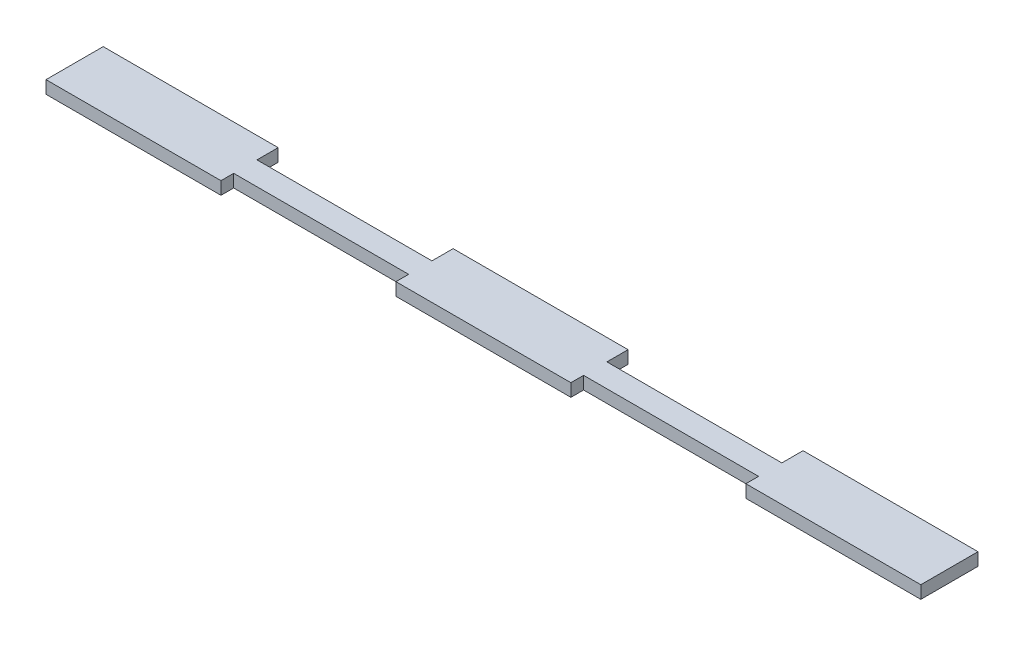
ISO-10303-21;
HEADER;
FILE_DESCRIPTION(('STEP AP214'),'2;1');
FILE_NAME('part.step','',(''),(''),'','','');
FILE_SCHEMA(('AUTOMOTIVE_DESIGN { 1 0 10303 214 1 1 1 1 }'));
ENDSEC;
DATA;
#1=APPLICATION_CONTEXT('core data for automotive mechanical design processes');
#2=APPLICATION_PROTOCOL_DEFINITION('international standard','automotive_design',2000,#1);
#3=PRODUCT_CONTEXT('',#1,'mechanical');
#4=PRODUCT('Part','Part','',(#3));
#5=PRODUCT_RELATED_PRODUCT_CATEGORY('part','',(#4));
#6=PRODUCT_DEFINITION_FORMATION('','',#4);
#7=PRODUCT_DEFINITION_CONTEXT('part definition',#1,'design');
#8=PRODUCT_DEFINITION('design','',#6,#7);
#9=PRODUCT_DEFINITION_SHAPE('','',#8);
#10=(LENGTH_UNIT() NAMED_UNIT(*) SI_UNIT(.MILLI.,.METRE.));
#11=(NAMED_UNIT(*) PLANE_ANGLE_UNIT() SI_UNIT($,.RADIAN.));
#12=(NAMED_UNIT(*) SI_UNIT($,.STERADIAN.) SOLID_ANGLE_UNIT());
#13=UNCERTAINTY_MEASURE_WITH_UNIT(LENGTH_MEASURE(1.E-05),#10,'distance_accuracy_value','');
#14=(GEOMETRIC_REPRESENTATION_CONTEXT(3) GLOBAL_UNCERTAINTY_ASSIGNED_CONTEXT((#13)) GLOBAL_UNIT_ASSIGNED_CONTEXT((#10,
#11,#12)) REPRESENTATION_CONTEXT('',''));
#15=CARTESIAN_POINT('',(0.,0.,0.));
#16=DIRECTION('',(0.,0.,1.));
#17=DIRECTION('',(1.,0.,0.));
#18=AXIS2_PLACEMENT_3D('',#15,#16,#17);
#19=CARTESIAN_POINT('',(61.9499999999999,3.,6.75));
#20=DIRECTION('',(0.,0.,-1.));
#21=DIRECTION('',(-1.,0.,0.));
#22=AXIS2_PLACEMENT_3D('',#19,#20,#21);
#23=PLANE('',#22);
#24=DIRECTION('',(1.,0.,0.));
#25=VECTOR('',#24,1.);
#26=CARTESIAN_POINT('',(61.9499999999999,0.,6.75));
#27=LINE('',#26,#25);
#28=CARTESIAN_POINT('',(61.9499999999999,0.,6.75));
#29=VERTEX_POINT('',#28);
#30=CARTESIAN_POINT('',(103.25,0.,6.75));
#31=VERTEX_POINT('',#30);
#32=EDGE_CURVE('E200',#29,#31,#27,.T.);
#33=ORIENTED_EDGE('',*,*,#32,.T.);
#34=DIRECTION('',(0.,-1.,0.));
#35=VECTOR('',#34,1.);
#36=CARTESIAN_POINT('',(103.25,3.,6.75));
#37=LINE('',#36,#35);
#38=CARTESIAN_POINT('',(103.25,3.,6.75));
#39=VERTEX_POINT('',#38);
#40=EDGE_CURVE('E11',#39,#31,#37,.T.);
#41=ORIENTED_EDGE('',*,*,#40,.F.);
#42=DIRECTION('',(1.,0.,0.));
#43=VECTOR('',#42,1.);
#44=CARTESIAN_POINT('',(61.9499999999999,3.,6.75));
#45=LINE('',#44,#43);
#46=CARTESIAN_POINT('',(61.9499999999999,3.,6.75));
#47=VERTEX_POINT('',#46);
#48=EDGE_CURVE('E238',#47,#39,#45,.T.);
#49=ORIENTED_EDGE('',*,*,#48,.F.);
#50=DIRECTION('',(0.,-1.,0.));
#51=VECTOR('',#50,1.);
#52=CARTESIAN_POINT('',(61.9499999999999,3.,6.75));
#53=LINE('',#52,#51);
#54=EDGE_CURVE('E196',#47,#29,#53,.T.);
#55=ORIENTED_EDGE('',*,*,#54,.T.);
#56=EDGE_LOOP('',(#33,#41,#49,#55));
#57=FACE_BOUND('',#56,.T.);
#58=ADVANCED_FACE('F32',(#57),#23,.F.);
#59=CARTESIAN_POINT('',(103.25,3.,-6.75));
#60=DIRECTION('',(-1.,0.,0.));
#61=DIRECTION('',(0.,0.,1.));
#62=AXIS2_PLACEMENT_3D('',#59,#60,#61);
#63=PLANE('',#62);
#64=DIRECTION('',(0.,0.,-1.));
#65=VECTOR('',#64,1.);
#66=CARTESIAN_POINT('',(103.25,0.,-6.75));
#67=LINE('',#66,#65);
#68=CARTESIAN_POINT('',(103.25,0.,-6.75));
#69=VERTEX_POINT('',#68);
#70=EDGE_CURVE('E203',#31,#69,#67,.T.);
#71=ORIENTED_EDGE('',*,*,#70,.T.);
#72=DIRECTION('',(0.,-1.,0.));
#73=VECTOR('',#72,1.);
#74=CARTESIAN_POINT('',(103.25,3.,-6.75));
#75=LINE('',#74,#73);
#76=CARTESIAN_POINT('',(103.25,3.,-6.75));
#77=VERTEX_POINT('',#76);
#78=EDGE_CURVE('E40',#77,#69,#75,.T.);
#79=ORIENTED_EDGE('',*,*,#78,.F.);
#80=DIRECTION('',(0.,0.,-1.));
#81=VECTOR('',#80,1.);
#82=CARTESIAN_POINT('',(103.25,3.,-6.75));
#83=LINE('',#82,#81);
#84=EDGE_CURVE('E127',#39,#77,#83,.T.);
#85=ORIENTED_EDGE('',*,*,#84,.F.);
#86=ORIENTED_EDGE('',*,*,#40,.T.);
#87=EDGE_LOOP('',(#71,#79,#85,#86));
#88=FACE_BOUND('',#87,.T.);
#89=ADVANCED_FACE('F356',(#88),#63,.F.);
#90=CARTESIAN_POINT('',(61.9499999999999,3.,-6.75));
#91=DIRECTION('',(0.,0.,1.));
#92=DIRECTION('',(1.,0.,0.));
#93=AXIS2_PLACEMENT_3D('',#90,#91,#92);
#94=PLANE('',#93);
#95=DIRECTION('',(-1.,0.,0.));
#96=VECTOR('',#95,1.);
#97=CARTESIAN_POINT('',(61.9499999999999,0.,-6.75));
#98=LINE('',#97,#96);
#99=CARTESIAN_POINT('',(61.9499999999999,0.,-6.75));
#100=VERTEX_POINT('',#99);
#101=EDGE_CURVE('E205',#69,#100,#98,.T.);
#102=ORIENTED_EDGE('',*,*,#101,.T.);
#103=DIRECTION('',(0.,-1.,0.));
#104=VECTOR('',#103,1.);
#105=CARTESIAN_POINT('',(61.9499999999999,3.,-6.75));
#106=LINE('',#105,#104);
#107=CARTESIAN_POINT('',(61.9499999999999,3.,-6.75));
#108=VERTEX_POINT('',#107);
#109=EDGE_CURVE('E281',#108,#100,#106,.T.);
#110=ORIENTED_EDGE('',*,*,#109,.F.);
#111=DIRECTION('',(-1.,0.,0.));
#112=VECTOR('',#111,1.);
#113=CARTESIAN_POINT('',(61.9499999999999,3.,-6.75));
#114=LINE('',#113,#112);
#115=EDGE_CURVE('E289',#77,#108,#114,.T.);
#116=ORIENTED_EDGE('',*,*,#115,.F.);
#117=ORIENTED_EDGE('',*,*,#78,.T.);
#118=EDGE_LOOP('',(#102,#110,#116,#117));
#119=FACE_BOUND('',#118,.T.);
#120=ADVANCED_FACE('F287',(#119),#94,.F.);
#121=CARTESIAN_POINT('',(61.9499999999999,3.,-6.75));
#122=DIRECTION('',(1.,0.,0.));
#123=DIRECTION('',(0.,0.,-1.));
#124=AXIS2_PLACEMENT_3D('',#121,#122,#123);
#125=PLANE('',#124);
#126=DIRECTION('',(0.,0.,1.));
#127=VECTOR('',#126,1.);
#128=CARTESIAN_POINT('',(61.9499999999999,0.,-6.75));
#129=LINE('',#128,#127);
#130=CARTESIAN_POINT('',(61.9499999999999,0.,-1.75));
#131=VERTEX_POINT('',#130);
#132=EDGE_CURVE('E207',#100,#131,#129,.T.);
#133=ORIENTED_EDGE('',*,*,#132,.T.);
#134=DIRECTION('',(0.,-1.,0.));
#135=VECTOR('',#134,1.);
#136=CARTESIAN_POINT('',(61.9499999999999,3.,-1.75));
#137=LINE('',#136,#135);
#138=CARTESIAN_POINT('',(61.9499999999999,3.,-1.75));
#139=VERTEX_POINT('',#138);
#140=EDGE_CURVE('E278',#139,#131,#137,.T.);
#141=ORIENTED_EDGE('',*,*,#140,.F.);
#142=DIRECTION('',(0.,0.,1.));
#143=VECTOR('',#142,1.);
#144=CARTESIAN_POINT('',(61.9499999999999,3.,-6.75));
#145=LINE('',#144,#143);
#146=EDGE_CURVE('E307',#108,#139,#145,.T.);
#147=ORIENTED_EDGE('',*,*,#146,.F.);
#148=ORIENTED_EDGE('',*,*,#109,.T.);
#149=EDGE_LOOP('',(#133,#141,#147,#148));
#150=FACE_BOUND('',#149,.T.);
#151=ADVANCED_FACE('F298',(#150),#125,.F.);
#152=CARTESIAN_POINT('',(20.65,3.,-1.75));
#153=DIRECTION('',(0.,0.,1.));
#154=DIRECTION('',(1.,0.,0.));
#155=AXIS2_PLACEMENT_3D('',#152,#153,#154);
#156=PLANE('',#155);
#157=DIRECTION('',(-1.,0.,0.));
#158=VECTOR('',#157,1.);
#159=CARTESIAN_POINT('',(20.65,0.,-1.75));
#160=LINE('',#159,#158);
#161=CARTESIAN_POINT('',(20.65,0.,-1.75));
#162=VERTEX_POINT('',#161);
#163=EDGE_CURVE('E209',#131,#162,#160,.T.);
#164=ORIENTED_EDGE('',*,*,#163,.T.);
#165=DIRECTION('',(0.,-1.,0.));
#166=VECTOR('',#165,1.);
#167=CARTESIAN_POINT('',(20.65,3.,-1.75));
#168=LINE('',#167,#166);
#169=CARTESIAN_POINT('',(20.65,3.,-1.75));
#170=VERTEX_POINT('',#169);
#171=EDGE_CURVE('E275',#170,#162,#168,.T.);
#172=ORIENTED_EDGE('',*,*,#171,.F.);
#173=DIRECTION('',(-1.,0.,0.));
#174=VECTOR('',#173,1.);
#175=CARTESIAN_POINT('',(20.65,3.,-1.75));
#176=LINE('',#175,#174);
#177=EDGE_CURVE('E304',#139,#170,#176,.T.);
#178=ORIENTED_EDGE('',*,*,#177,.F.);
#179=ORIENTED_EDGE('',*,*,#140,.T.);
#180=EDGE_LOOP('',(#164,#172,#178,#179));
#181=FACE_BOUND('',#180,.T.);
#182=ADVANCED_FACE('F302',(#181),#156,.F.);
#183=CARTESIAN_POINT('',(20.65,3.,-6.75));
#184=DIRECTION('',(-1.,0.,0.));
#185=DIRECTION('',(0.,0.,1.));
#186=AXIS2_PLACEMENT_3D('',#183,#184,#185);
#187=PLANE('',#186);
#188=DIRECTION('',(0.,0.,-1.));
#189=VECTOR('',#188,1.);
#190=CARTESIAN_POINT('',(20.65,0.,-6.75));
#191=LINE('',#190,#189);
#192=CARTESIAN_POINT('',(20.65,0.,-6.75));
#193=VERTEX_POINT('',#192);
#194=EDGE_CURVE('E211',#162,#193,#191,.T.);
#195=ORIENTED_EDGE('',*,*,#194,.T.);
#196=DIRECTION('',(0.,-1.,0.));
#197=VECTOR('',#196,1.);
#198=CARTESIAN_POINT('',(20.65,3.,-6.75));
#199=LINE('',#198,#197);
#200=CARTESIAN_POINT('',(20.65,3.,-6.75));
#201=VERTEX_POINT('',#200);
#202=EDGE_CURVE('E272',#201,#193,#199,.T.);
#203=ORIENTED_EDGE('',*,*,#202,.F.);
#204=DIRECTION('',(0.,0.,-1.));
#205=VECTOR('',#204,1.);
#206=CARTESIAN_POINT('',(20.65,3.,-6.75));
#207=LINE('',#206,#205);
#208=EDGE_CURVE('E306',#170,#201,#207,.T.);
#209=ORIENTED_EDGE('',*,*,#208,.F.);
#210=ORIENTED_EDGE('',*,*,#171,.T.);
#211=EDGE_LOOP('',(#195,#203,#209,#210));
#212=FACE_BOUND('',#211,.T.);
#213=ADVANCED_FACE('F369',(#212),#187,.F.);
#214=CARTESIAN_POINT('',(-20.65,3.,-6.75));
#215=DIRECTION('',(0.,0.,1.));
#216=DIRECTION('',(1.,0.,0.));
#217=AXIS2_PLACEMENT_3D('',#214,#215,#216);
#218=PLANE('',#217);
#219=DIRECTION('',(-1.,0.,0.));
#220=VECTOR('',#219,1.);
#221=CARTESIAN_POINT('',(-20.65,0.,-6.75));
#222=LINE('',#221,#220);
#223=CARTESIAN_POINT('',(-20.65,0.,-6.75));
#224=VERTEX_POINT('',#223);
#225=EDGE_CURVE('E213',#193,#224,#222,.T.);
#226=ORIENTED_EDGE('',*,*,#225,.T.);
#227=DIRECTION('',(0.,-1.,0.));
#228=VECTOR('',#227,1.);
#229=CARTESIAN_POINT('',(-20.65,3.,-6.75));
#230=LINE('',#229,#228);
#231=CARTESIAN_POINT('',(-20.65,3.,-6.75));
#232=VERTEX_POINT('',#231);
#233=EDGE_CURVE('E269',#232,#224,#230,.T.);
#234=ORIENTED_EDGE('',*,*,#233,.F.);
#235=DIRECTION('',(-1.,0.,0.));
#236=VECTOR('',#235,1.);
#237=CARTESIAN_POINT('',(-20.65,3.,-6.75));
#238=LINE('',#237,#236);
#239=EDGE_CURVE('E309',#201,#232,#238,.T.);
#240=ORIENTED_EDGE('',*,*,#239,.F.);
#241=ORIENTED_EDGE('',*,*,#202,.T.);
#242=EDGE_LOOP('',(#226,#234,#240,#241));
#243=FACE_BOUND('',#242,.T.);
#244=ADVANCED_FACE('F372',(#243),#218,.F.);
#245=CARTESIAN_POINT('',(-20.65,3.,-6.75));
#246=DIRECTION('',(1.,0.,0.));
#247=DIRECTION('',(0.,0.,-1.));
#248=AXIS2_PLACEMENT_3D('',#245,#246,#247);
#249=PLANE('',#248);
#250=DIRECTION('',(0.,0.,1.));
#251=VECTOR('',#250,1.);
#252=CARTESIAN_POINT('',(-20.65,0.,-6.75));
#253=LINE('',#252,#251);
#254=CARTESIAN_POINT('',(-20.65,0.,-1.75));
#255=VERTEX_POINT('',#254);
#256=EDGE_CURVE('E215',#224,#255,#253,.T.);
#257=ORIENTED_EDGE('',*,*,#256,.T.);
#258=DIRECTION('',(0.,-1.,0.));
#259=VECTOR('',#258,1.);
#260=CARTESIAN_POINT('',(-20.65,3.,-1.75));
#261=LINE('',#260,#259);
#262=CARTESIAN_POINT('',(-20.65,3.,-1.75));
#263=VERTEX_POINT('',#262);
#264=EDGE_CURVE('E266',#263,#255,#261,.T.);
#265=ORIENTED_EDGE('',*,*,#264,.F.);
#266=DIRECTION('',(0.,0.,1.));
#267=VECTOR('',#266,1.);
#268=CARTESIAN_POINT('',(-20.65,3.,-6.75));
#269=LINE('',#268,#267);
#270=EDGE_CURVE('E315',#232,#263,#269,.T.);
#271=ORIENTED_EDGE('',*,*,#270,.F.);
#272=ORIENTED_EDGE('',*,*,#233,.T.);
#273=EDGE_LOOP('',(#257,#265,#271,#272));
#274=FACE_BOUND('',#273,.T.);
#275=ADVANCED_FACE('F376',(#274),#249,.F.);
#276=CARTESIAN_POINT('',(-61.95,3.,-1.75));
#277=DIRECTION('',(0.,0.,1.));
#278=DIRECTION('',(1.,0.,0.));
#279=AXIS2_PLACEMENT_3D('',#276,#277,#278);
#280=PLANE('',#279);
#281=DIRECTION('',(-1.,0.,0.));
#282=VECTOR('',#281,1.);
#283=CARTESIAN_POINT('',(-61.95,0.,-1.75));
#284=LINE('',#283,#282);
#285=CARTESIAN_POINT('',(-61.95,0.,-1.75));
#286=VERTEX_POINT('',#285);
#287=EDGE_CURVE('E217',#255,#286,#284,.T.);
#288=ORIENTED_EDGE('',*,*,#287,.T.);
#289=DIRECTION('',(0.,-1.,0.));
#290=VECTOR('',#289,1.);
#291=CARTESIAN_POINT('',(-61.95,3.,-1.75));
#292=LINE('',#291,#290);
#293=CARTESIAN_POINT('',(-61.95,3.,-1.75));
#294=VERTEX_POINT('',#293);
#295=EDGE_CURVE('E263',#294,#286,#292,.T.);
#296=ORIENTED_EDGE('',*,*,#295,.F.);
#297=DIRECTION('',(-1.,0.,0.));
#298=VECTOR('',#297,1.);
#299=CARTESIAN_POINT('',(-61.95,3.,-1.75));
#300=LINE('',#299,#298);
#301=EDGE_CURVE('E317',#263,#294,#300,.T.);
#302=ORIENTED_EDGE('',*,*,#301,.F.);
#303=ORIENTED_EDGE('',*,*,#264,.T.);
#304=EDGE_LOOP('',(#288,#296,#302,#303));
#305=FACE_BOUND('',#304,.T.);
#306=ADVANCED_FACE('F380',(#305),#280,.F.);
#307=CARTESIAN_POINT('',(-61.95,3.,-6.75));
#308=DIRECTION('',(-1.,0.,0.));
#309=DIRECTION('',(0.,0.,1.));
#310=AXIS2_PLACEMENT_3D('',#307,#308,#309);
#311=PLANE('',#310);
#312=DIRECTION('',(0.,0.,-1.));
#313=VECTOR('',#312,1.);
#314=CARTESIAN_POINT('',(-61.95,0.,-6.75));
#315=LINE('',#314,#313);
#316=CARTESIAN_POINT('',(-61.95,0.,-6.75));
#317=VERTEX_POINT('',#316);
#318=EDGE_CURVE('E219',#286,#317,#315,.T.);
#319=ORIENTED_EDGE('',*,*,#318,.T.);
#320=DIRECTION('',(0.,-1.,0.));
#321=VECTOR('',#320,1.);
#322=CARTESIAN_POINT('',(-61.95,3.,-6.75));
#323=LINE('',#322,#321);
#324=CARTESIAN_POINT('',(-61.95,3.,-6.75));
#325=VERTEX_POINT('',#324);
#326=EDGE_CURVE('E260',#325,#317,#323,.T.);
#327=ORIENTED_EDGE('',*,*,#326,.F.);
#328=DIRECTION('',(0.,0.,-1.));
#329=VECTOR('',#328,1.);
#330=CARTESIAN_POINT('',(-61.95,3.,-6.75));
#331=LINE('',#330,#329);
#332=EDGE_CURVE('E319',#294,#325,#331,.T.);
#333=ORIENTED_EDGE('',*,*,#332,.F.);
#334=ORIENTED_EDGE('',*,*,#295,.T.);
#335=EDGE_LOOP('',(#319,#327,#333,#334));
#336=FACE_BOUND('',#335,.T.);
#337=ADVANCED_FACE('F384',(#336),#311,.F.);
#338=CARTESIAN_POINT('',(-103.25,3.,-6.75));
#339=DIRECTION('',(0.,0.,1.));
#340=DIRECTION('',(1.,0.,0.));
#341=AXIS2_PLACEMENT_3D('',#338,#339,#340);
#342=PLANE('',#341);
#343=DIRECTION('',(-1.,0.,0.));
#344=VECTOR('',#343,1.);
#345=CARTESIAN_POINT('',(-103.25,0.,-6.75));
#346=LINE('',#345,#344);
#347=CARTESIAN_POINT('',(-103.25,0.,-6.75));
#348=VERTEX_POINT('',#347);
#349=EDGE_CURVE('E221',#317,#348,#346,.T.);
#350=ORIENTED_EDGE('',*,*,#349,.T.);
#351=DIRECTION('',(0.,-1.,0.));
#352=VECTOR('',#351,1.);
#353=CARTESIAN_POINT('',(-103.25,3.,-6.75));
#354=LINE('',#353,#352);
#355=CARTESIAN_POINT('',(-103.25,3.,-6.75));
#356=VERTEX_POINT('',#355);
#357=EDGE_CURVE('E257',#356,#348,#354,.T.);
#358=ORIENTED_EDGE('',*,*,#357,.F.);
#359=DIRECTION('',(-1.,0.,0.));
#360=VECTOR('',#359,1.);
#361=CARTESIAN_POINT('',(-103.25,3.,-6.75));
#362=LINE('',#361,#360);
#363=EDGE_CURVE('E321',#325,#356,#362,.T.);
#364=ORIENTED_EDGE('',*,*,#363,.F.);
#365=ORIENTED_EDGE('',*,*,#326,.T.);
#366=EDGE_LOOP('',(#350,#358,#364,#365));
#367=FACE_BOUND('',#366,.T.);
#368=ADVANCED_FACE('F388',(#367),#342,.F.);
#369=CARTESIAN_POINT('',(-103.25,3.,-6.75));
#370=DIRECTION('',(1.,0.,0.));
#371=DIRECTION('',(0.,0.,-1.));
#372=AXIS2_PLACEMENT_3D('',#369,#370,#371);
#373=PLANE('',#372);
#374=DIRECTION('',(0.,0.,1.));
#375=VECTOR('',#374,1.);
#376=CARTESIAN_POINT('',(-103.25,0.,-6.75));
#377=LINE('',#376,#375);
#378=CARTESIAN_POINT('',(-103.25,0.,6.75));
#379=VERTEX_POINT('',#378);
#380=EDGE_CURVE('E223',#348,#379,#377,.T.);
#381=ORIENTED_EDGE('',*,*,#380,.T.);
#382=DIRECTION('',(0.,-1.,0.));
#383=VECTOR('',#382,1.);
#384=CARTESIAN_POINT('',(-103.25,3.,6.75));
#385=LINE('',#384,#383);
#386=CARTESIAN_POINT('',(-103.25,3.,6.75));
#387=VERTEX_POINT('',#386);
#388=EDGE_CURVE('E254',#387,#379,#385,.T.);
#389=ORIENTED_EDGE('',*,*,#388,.F.);
#390=DIRECTION('',(0.,0.,1.));
#391=VECTOR('',#390,1.);
#392=CARTESIAN_POINT('',(-103.25,3.,-6.75));
#393=LINE('',#392,#391);
#394=EDGE_CURVE('E323',#356,#387,#393,.T.);
#395=ORIENTED_EDGE('',*,*,#394,.F.);
#396=ORIENTED_EDGE('',*,*,#357,.T.);
#397=EDGE_LOOP('',(#381,#389,#395,#396));
#398=FACE_BOUND('',#397,.T.);
#399=ADVANCED_FACE('F392',(#398),#373,.F.);
#400=CARTESIAN_POINT('',(-103.25,3.,6.75));
#401=DIRECTION('',(0.,0.,-1.));
#402=DIRECTION('',(-1.,0.,0.));
#403=AXIS2_PLACEMENT_3D('',#400,#401,#402);
#404=PLANE('',#403);
#405=DIRECTION('',(1.,0.,0.));
#406=VECTOR('',#405,1.);
#407=CARTESIAN_POINT('',(-103.25,0.,6.75));
#408=LINE('',#407,#406);
#409=CARTESIAN_POINT('',(-61.95,0.,6.75));
#410=VERTEX_POINT('',#409);
#411=EDGE_CURVE('E225',#379,#410,#408,.T.);
#412=ORIENTED_EDGE('',*,*,#411,.T.);
#413=DIRECTION('',(0.,-1.,0.));
#414=VECTOR('',#413,1.);
#415=CARTESIAN_POINT('',(-61.95,3.,6.75));
#416=LINE('',#415,#414);
#417=CARTESIAN_POINT('',(-61.95,3.,6.75));
#418=VERTEX_POINT('',#417);
#419=EDGE_CURVE('E251',#418,#410,#416,.T.);
#420=ORIENTED_EDGE('',*,*,#419,.F.);
#421=DIRECTION('',(1.,0.,0.));
#422=VECTOR('',#421,1.);
#423=CARTESIAN_POINT('',(-103.25,3.,6.75));
#424=LINE('',#423,#422);
#425=EDGE_CURVE('E325',#387,#418,#424,.T.);
#426=ORIENTED_EDGE('',*,*,#425,.F.);
#427=ORIENTED_EDGE('',*,*,#388,.T.);
#428=EDGE_LOOP('',(#412,#420,#426,#427));
#429=FACE_BOUND('',#428,.T.);
#430=ADVANCED_FACE('F396',(#429),#404,.F.);
#431=CARTESIAN_POINT('',(-61.95,3.,3.75));
#432=DIRECTION('',(-1.,0.,0.));
#433=DIRECTION('',(0.,0.,1.));
#434=AXIS2_PLACEMENT_3D('',#431,#432,#433);
#435=PLANE('',#434);
#436=DIRECTION('',(0.,0.,-1.));
#437=VECTOR('',#436,1.);
#438=CARTESIAN_POINT('',(-61.95,0.,3.75));
#439=LINE('',#438,#437);
#440=CARTESIAN_POINT('',(-61.95,0.,3.75));
#441=VERTEX_POINT('',#440);
#442=EDGE_CURVE('E227',#410,#441,#439,.T.);
#443=ORIENTED_EDGE('',*,*,#442,.T.);
#444=DIRECTION('',(0.,-1.,0.));
#445=VECTOR('',#444,1.);
#446=CARTESIAN_POINT('',(-61.95,3.,3.75));
#447=LINE('',#446,#445);
#448=CARTESIAN_POINT('',(-61.95,3.,3.75));
#449=VERTEX_POINT('',#448);
#450=EDGE_CURVE('E248',#449,#441,#447,.T.);
#451=ORIENTED_EDGE('',*,*,#450,.F.);
#452=DIRECTION('',(0.,0.,-1.));
#453=VECTOR('',#452,1.);
#454=CARTESIAN_POINT('',(-61.95,3.,3.75));
#455=LINE('',#454,#453);
#456=EDGE_CURVE('E327',#418,#449,#455,.T.);
#457=ORIENTED_EDGE('',*,*,#456,.F.);
#458=ORIENTED_EDGE('',*,*,#419,.T.);
#459=EDGE_LOOP('',(#443,#451,#457,#458));
#460=FACE_BOUND('',#459,.T.);
#461=ADVANCED_FACE('F400',(#460),#435,.F.);
#462=CARTESIAN_POINT('',(-61.95,3.,3.75));
#463=DIRECTION('',(0.,0.,-1.));
#464=DIRECTION('',(-1.,0.,0.));
#465=AXIS2_PLACEMENT_3D('',#462,#463,#464);
#466=PLANE('',#465);
#467=DIRECTION('',(1.,0.,0.));
#468=VECTOR('',#467,1.);
#469=CARTESIAN_POINT('',(-61.95,0.,3.75));
#470=LINE('',#469,#468);
#471=CARTESIAN_POINT('',(-20.65,0.,3.75));
#472=VERTEX_POINT('',#471);
#473=EDGE_CURVE('E229',#441,#472,#470,.T.);
#474=ORIENTED_EDGE('',*,*,#473,.T.);
#475=DIRECTION('',(0.,-1.,0.));
#476=VECTOR('',#475,1.);
#477=CARTESIAN_POINT('',(-20.65,3.,3.75));
#478=LINE('',#477,#476);
#479=CARTESIAN_POINT('',(-20.65,3.,3.75));
#480=VERTEX_POINT('',#479);
#481=EDGE_CURVE('E245',#480,#472,#478,.T.);
#482=ORIENTED_EDGE('',*,*,#481,.F.);
#483=DIRECTION('',(1.,0.,0.));
#484=VECTOR('',#483,1.);
#485=CARTESIAN_POINT('',(-61.95,3.,3.75));
#486=LINE('',#485,#484);
#487=EDGE_CURVE('E329',#449,#480,#486,.T.);
#488=ORIENTED_EDGE('',*,*,#487,.F.);
#489=ORIENTED_EDGE('',*,*,#450,.T.);
#490=EDGE_LOOP('',(#474,#482,#488,#489));
#491=FACE_BOUND('',#490,.T.);
#492=ADVANCED_FACE('F404',(#491),#466,.F.);
#493=CARTESIAN_POINT('',(-20.65,3.,3.75));
#494=DIRECTION('',(1.,0.,0.));
#495=DIRECTION('',(0.,0.,-1.));
#496=AXIS2_PLACEMENT_3D('',#493,#494,#495);
#497=PLANE('',#496);
#498=DIRECTION('',(0.,0.,1.));
#499=VECTOR('',#498,1.);
#500=CARTESIAN_POINT('',(-20.65,0.,3.75));
#501=LINE('',#500,#499);
#502=CARTESIAN_POINT('',(-20.65,0.,6.75));
#503=VERTEX_POINT('',#502);
#504=EDGE_CURVE('E231',#472,#503,#501,.T.);
#505=ORIENTED_EDGE('',*,*,#504,.T.);
#506=DIRECTION('',(0.,-1.,0.));
#507=VECTOR('',#506,1.);
#508=CARTESIAN_POINT('',(-20.65,3.,6.75));
#509=LINE('',#508,#507);
#510=CARTESIAN_POINT('',(-20.65,3.,6.75));
#511=VERTEX_POINT('',#510);
#512=EDGE_CURVE('E242',#511,#503,#509,.T.);
#513=ORIENTED_EDGE('',*,*,#512,.F.);
#514=DIRECTION('',(0.,0.,1.));
#515=VECTOR('',#514,1.);
#516=CARTESIAN_POINT('',(-20.65,3.,3.75));
#517=LINE('',#516,#515);
#518=EDGE_CURVE('E331',#480,#511,#517,.T.);
#519=ORIENTED_EDGE('',*,*,#518,.F.);
#520=ORIENTED_EDGE('',*,*,#481,.T.);
#521=EDGE_LOOP('',(#505,#513,#519,#520));
#522=FACE_BOUND('',#521,.T.);
#523=ADVANCED_FACE('F337',(#522),#497,.F.);
#524=CARTESIAN_POINT('',(-20.65,3.,6.75));
#525=DIRECTION('',(0.,0.,-1.));
#526=DIRECTION('',(-1.,0.,0.));
#527=AXIS2_PLACEMENT_3D('',#524,#525,#526);
#528=PLANE('',#527);
#529=DIRECTION('',(1.,0.,0.));
#530=VECTOR('',#529,1.);
#531=CARTESIAN_POINT('',(-20.65,0.,6.75));
#532=LINE('',#531,#530);
#533=CARTESIAN_POINT('',(20.65,0.,6.75));
#534=VERTEX_POINT('',#533);
#535=EDGE_CURVE('E233',#503,#534,#532,.T.);
#536=ORIENTED_EDGE('',*,*,#535,.T.);
#537=DIRECTION('',(0.,-1.,0.));
#538=VECTOR('',#537,1.);
#539=CARTESIAN_POINT('',(20.65,3.,6.75));
#540=LINE('',#539,#538);
#541=CARTESIAN_POINT('',(20.65,3.,6.75));
#542=VERTEX_POINT('',#541);
#543=EDGE_CURVE('E191',#542,#534,#540,.T.);
#544=ORIENTED_EDGE('',*,*,#543,.F.);
#545=DIRECTION('',(1.,0.,0.));
#546=VECTOR('',#545,1.);
#547=CARTESIAN_POINT('',(-20.65,3.,6.75));
#548=LINE('',#547,#546);
#549=EDGE_CURVE('E182',#511,#542,#548,.T.);
#550=ORIENTED_EDGE('',*,*,#549,.F.);
#551=ORIENTED_EDGE('',*,*,#512,.T.);
#552=EDGE_LOOP('',(#536,#544,#550,#551));
#553=FACE_BOUND('',#552,.T.);
#554=ADVANCED_FACE('F341',(#553),#528,.F.);
#555=CARTESIAN_POINT('',(20.65,3.,3.75));
#556=DIRECTION('',(-1.,0.,0.));
#557=DIRECTION('',(0.,0.,1.));
#558=AXIS2_PLACEMENT_3D('',#555,#556,#557);
#559=PLANE('',#558);
#560=DIRECTION('',(0.,0.,-1.));
#561=VECTOR('',#560,1.);
#562=CARTESIAN_POINT('',(20.65,0.,3.75));
#563=LINE('',#562,#561);
#564=CARTESIAN_POINT('',(20.65,0.,3.75));
#565=VERTEX_POINT('',#564);
#566=EDGE_CURVE('E190',#534,#565,#563,.T.);
#567=ORIENTED_EDGE('',*,*,#566,.T.);
#568=DIRECTION('',(0.,-1.,0.));
#569=VECTOR('',#568,1.);
#570=CARTESIAN_POINT('',(20.65,3.,3.75));
#571=LINE('',#570,#569);
#572=CARTESIAN_POINT('',(20.65,3.,3.75));
#573=VERTEX_POINT('',#572);
#574=EDGE_CURVE('E187',#573,#565,#571,.T.);
#575=ORIENTED_EDGE('',*,*,#574,.F.);
#576=DIRECTION('',(0.,0.,-1.));
#577=VECTOR('',#576,1.);
#578=CARTESIAN_POINT('',(20.65,3.,3.75));
#579=LINE('',#578,#577);
#580=EDGE_CURVE('E176',#542,#573,#579,.T.);
#581=ORIENTED_EDGE('',*,*,#580,.F.);
#582=ORIENTED_EDGE('',*,*,#543,.T.);
#583=EDGE_LOOP('',(#567,#575,#581,#582));
#584=FACE_BOUND('',#583,.T.);
#585=ADVANCED_FACE('F188',(#584),#559,.F.);
#586=CARTESIAN_POINT('',(20.65,3.,3.75));
#587=DIRECTION('',(0.,0.,-1.));
#588=DIRECTION('',(-1.,0.,0.));
#589=AXIS2_PLACEMENT_3D('',#586,#587,#588);
#590=PLANE('',#589);
#591=DIRECTION('',(1.,0.,0.));
#592=VECTOR('',#591,1.);
#593=CARTESIAN_POINT('',(20.65,0.,3.75));
#594=LINE('',#593,#592);
#595=CARTESIAN_POINT('',(61.9499999999999,0.,3.75));
#596=VERTEX_POINT('',#595);
#597=EDGE_CURVE('E113',#565,#596,#594,.T.);
#598=ORIENTED_EDGE('',*,*,#597,.T.);
#599=DIRECTION('',(0.,-1.,0.));
#600=VECTOR('',#599,1.);
#601=CARTESIAN_POINT('',(61.9499999999999,3.,3.75));
#602=LINE('',#601,#600);
#603=CARTESIAN_POINT('',(61.9499999999999,3.,3.75));
#604=VERTEX_POINT('',#603);
#605=EDGE_CURVE('E192',#604,#596,#602,.T.);
#606=ORIENTED_EDGE('',*,*,#605,.F.);
#607=DIRECTION('',(1.,0.,0.));
#608=VECTOR('',#607,1.);
#609=CARTESIAN_POINT('',(20.65,3.,3.75));
#610=LINE('',#609,#608);
#611=EDGE_CURVE('E180',#573,#604,#610,.T.);
#612=ORIENTED_EDGE('',*,*,#611,.F.);
#613=ORIENTED_EDGE('',*,*,#574,.T.);
#614=EDGE_LOOP('',(#598,#606,#612,#613));
#615=FACE_BOUND('',#614,.T.);
#616=ADVANCED_FACE('F194',(#615),#590,.F.);
#617=CARTESIAN_POINT('',(61.9499999999999,3.,3.75));
#618=DIRECTION('',(1.,0.,0.));
#619=DIRECTION('',(0.,0.,-1.));
#620=AXIS2_PLACEMENT_3D('',#617,#618,#619);
#621=PLANE('',#620);
#622=DIRECTION('',(0.,0.,1.));
#623=VECTOR('',#622,1.);
#624=CARTESIAN_POINT('',(61.9499999999999,0.,3.75));
#625=LINE('',#624,#623);
#626=EDGE_CURVE('E119',#596,#29,#625,.T.);
#627=ORIENTED_EDGE('',*,*,#626,.T.);
#628=ORIENTED_EDGE('',*,*,#54,.F.);
#629=DIRECTION('',(0.,0.,1.));
#630=VECTOR('',#629,1.);
#631=CARTESIAN_POINT('',(61.9499999999999,3.,3.75));
#632=LINE('',#631,#630);
#633=EDGE_CURVE('E48',#604,#47,#632,.T.);
#634=ORIENTED_EDGE('',*,*,#633,.F.);
#635=ORIENTED_EDGE('',*,*,#605,.T.);
#636=EDGE_LOOP('',(#627,#628,#634,#635));
#637=FACE_BOUND('',#636,.T.);
#638=ADVANCED_FACE('F345',(#637),#621,.F.);
#639=CARTESIAN_POINT('',(0.,3.,0.));
#640=DIRECTION('',(0.,-1.,0.));
#641=DIRECTION('',(0.,0.,-1.));
#642=AXIS2_PLACEMENT_3D('',#639,#640,#641);
#643=PLANE('',#642);
#644=ORIENTED_EDGE('',*,*,#48,.T.);
#645=ORIENTED_EDGE('',*,*,#84,.T.);
#646=ORIENTED_EDGE('',*,*,#115,.T.);
#647=ORIENTED_EDGE('',*,*,#146,.T.);
#648=ORIENTED_EDGE('',*,*,#177,.T.);
#649=ORIENTED_EDGE('',*,*,#208,.T.);
#650=ORIENTED_EDGE('',*,*,#239,.T.);
#651=ORIENTED_EDGE('',*,*,#270,.T.);
#652=ORIENTED_EDGE('',*,*,#301,.T.);
#653=ORIENTED_EDGE('',*,*,#332,.T.);
#654=ORIENTED_EDGE('',*,*,#363,.T.);
#655=ORIENTED_EDGE('',*,*,#394,.T.);
#656=ORIENTED_EDGE('',*,*,#425,.T.);
#657=ORIENTED_EDGE('',*,*,#456,.T.);
#658=ORIENTED_EDGE('',*,*,#487,.T.);
#659=ORIENTED_EDGE('',*,*,#518,.T.);
#660=ORIENTED_EDGE('',*,*,#549,.T.);
#661=ORIENTED_EDGE('',*,*,#580,.T.);
#662=ORIENTED_EDGE('',*,*,#611,.T.);
#663=ORIENTED_EDGE('',*,*,#633,.T.);
#664=EDGE_LOOP('',(#644,#645,#646,#647,#648,#649,#650,#651,#652,#653,#654,#655,#656,#657,#658,
#659,#660,#661,#662,#663));
#665=FACE_BOUND('',#664,.T.);
#666=ADVANCED_FACE('F178',(#665),#643,.F.);
#667=CARTESIAN_POINT('',(0.,0.,0.));
#668=DIRECTION('',(0.,-1.,0.));
#669=DIRECTION('',(0.,0.,-1.));
#670=AXIS2_PLACEMENT_3D('',#667,#668,#669);
#671=PLANE('',#670);
#672=ORIENTED_EDGE('',*,*,#32,.F.);
#673=ORIENTED_EDGE('',*,*,#626,.F.);
#674=ORIENTED_EDGE('',*,*,#597,.F.);
#675=ORIENTED_EDGE('',*,*,#566,.F.);
#676=ORIENTED_EDGE('',*,*,#535,.F.);
#677=ORIENTED_EDGE('',*,*,#504,.F.);
#678=ORIENTED_EDGE('',*,*,#473,.F.);
#679=ORIENTED_EDGE('',*,*,#442,.F.);
#680=ORIENTED_EDGE('',*,*,#411,.F.);
#681=ORIENTED_EDGE('',*,*,#380,.F.);
#682=ORIENTED_EDGE('',*,*,#349,.F.);
#683=ORIENTED_EDGE('',*,*,#318,.F.);
#684=ORIENTED_EDGE('',*,*,#287,.F.);
#685=ORIENTED_EDGE('',*,*,#256,.F.);
#686=ORIENTED_EDGE('',*,*,#225,.F.);
#687=ORIENTED_EDGE('',*,*,#194,.F.);
#688=ORIENTED_EDGE('',*,*,#163,.F.);
#689=ORIENTED_EDGE('',*,*,#132,.F.);
#690=ORIENTED_EDGE('',*,*,#101,.F.);
#691=ORIENTED_EDGE('',*,*,#70,.F.);
#692=EDGE_LOOP('',(#672,#673,#674,#675,#676,#677,#678,#679,#680,#681,#682,#683,#684,#685,#686,
#687,#688,#689,#690,#691));
#693=FACE_BOUND('',#692,.T.);
#694=ADVANCED_FACE('F293',(#693),#671,.T.);
#695=CLOSED_SHELL('',(#58,#89,#120,#151,#182,#213,#244,#275,#306,#337,#368,#399,#430,#461,#492,
#523,#554,#585,#616,#638,#666,#694));
#696=MANIFOLD_SOLID_BREP('B2',#695);
#697=ADVANCED_BREP_SHAPE_REPRESENTATION('',(#18,#696),#14);
#698=SHAPE_DEFINITION_REPRESENTATION(#9,#697);
ENDSEC;
END-ISO-10303-21;
